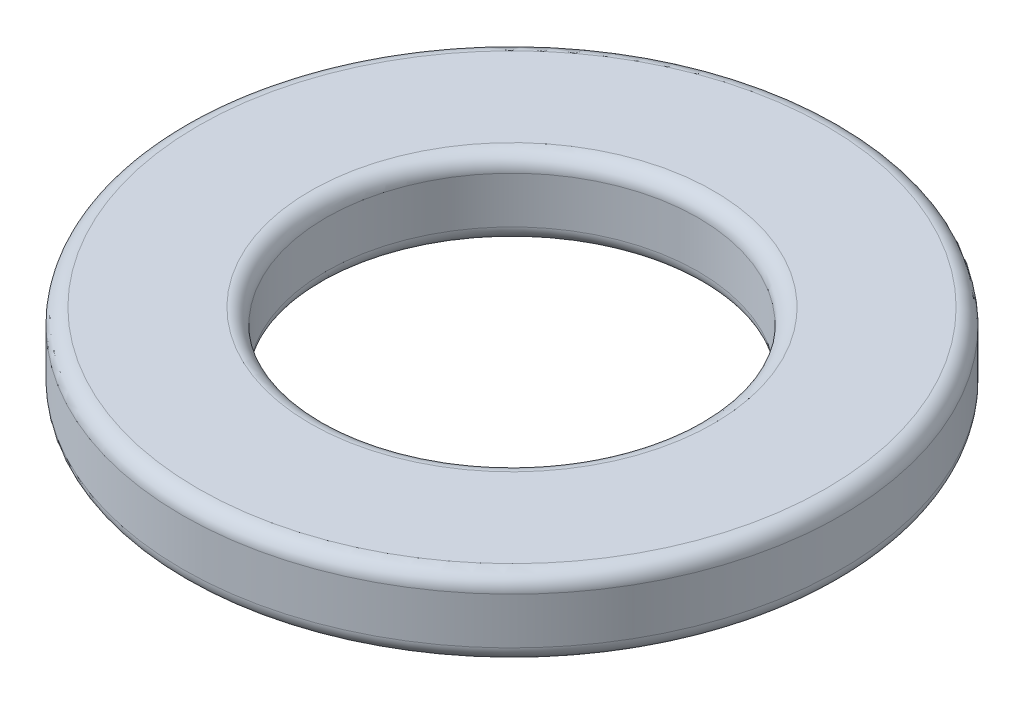
ISO-10303-21;
HEADER;
FILE_DESCRIPTION(('STEP AP214'),'2;1');
FILE_NAME('part.step','',(''),(''),'','','');
FILE_SCHEMA(('AUTOMOTIVE_DESIGN { 1 0 10303 214 1 1 1 1 }'));
ENDSEC;
DATA;
#1=APPLICATION_CONTEXT('core data for automotive mechanical design processes');
#2=APPLICATION_PROTOCOL_DEFINITION('international standard','automotive_design',2000,#1);
#3=PRODUCT_CONTEXT('',#1,'mechanical');
#4=PRODUCT('Part','Part','',(#3));
#5=PRODUCT_RELATED_PRODUCT_CATEGORY('part','',(#4));
#6=PRODUCT_DEFINITION_FORMATION('','',#4);
#7=PRODUCT_DEFINITION_CONTEXT('part definition',#1,'design');
#8=PRODUCT_DEFINITION('design','',#6,#7);
#9=PRODUCT_DEFINITION_SHAPE('','',#8);
#10=(LENGTH_UNIT() NAMED_UNIT(*) SI_UNIT(.MILLI.,.METRE.));
#11=(NAMED_UNIT(*) PLANE_ANGLE_UNIT() SI_UNIT($,.RADIAN.));
#12=(NAMED_UNIT(*) SI_UNIT($,.STERADIAN.) SOLID_ANGLE_UNIT());
#13=UNCERTAINTY_MEASURE_WITH_UNIT(LENGTH_MEASURE(1.E-05),#10,'distance_accuracy_value','');
#14=(GEOMETRIC_REPRESENTATION_CONTEXT(3) GLOBAL_UNCERTAINTY_ASSIGNED_CONTEXT((#13)) GLOBAL_UNIT_ASSIGNED_CONTEXT((#10,
#11,#12)) REPRESENTATION_CONTEXT('',''));
#15=CARTESIAN_POINT('',(0.,0.,0.));
#16=DIRECTION('',(0.,0.,1.));
#17=DIRECTION('',(1.,0.,0.));
#18=AXIS2_PLACEMENT_3D('',#15,#16,#17);
#19=CARTESIAN_POINT('',(0.,1.,0.));
#20=DIRECTION('',(0.,1.,0.));
#21=DIRECTION('',(0.,0.,1.));
#22=AXIS2_PLACEMENT_3D('',#19,#20,#21);
#23=PLANE('',#22);
#24=CARTESIAN_POINT('',(0.,1.,0.));
#25=DIRECTION('',(0.,1.,0.));
#26=DIRECTION('',(0.,0.,1.));
#27=AXIS2_PLACEMENT_3D('',#24,#25,#26);
#28=CIRCLE('',#27,4.05);
#29=CARTESIAN_POINT('',(0.,1.,4.05));
#30=VERTEX_POINT('',#29);
#31=EDGE_CURVE('E10',#30,#30,#28,.T.);
#32=ORIENTED_EDGE('',*,*,#31,.T.);
#33=EDGE_LOOP('',(#32));
#34=FACE_BOUND('',#33,.T.);
#35=CARTESIAN_POINT('',(0.,1.,0.));
#36=DIRECTION('',(0.,1.,0.));
#37=DIRECTION('',(0.,0.,1.));
#38=AXIS2_PLACEMENT_3D('',#35,#36,#37);
#39=CIRCLE('',#38,2.6);
#40=CARTESIAN_POINT('',(0.,1.,2.6));
#41=VERTEX_POINT('',#40);
#42=EDGE_CURVE('E50',#41,#41,#39,.F.);
#43=ORIENTED_EDGE('',*,*,#42,.T.);
#44=EDGE_LOOP('',(#43));
#45=FACE_BOUND('',#44,.T.);
#46=ADVANCED_FACE('F43',(#34,#45),#23,.T.);
#47=CARTESIAN_POINT('',(0.,0.,0.));
#48=DIRECTION('',(0.,1.,0.));
#49=DIRECTION('',(0.,0.,1.));
#50=AXIS2_PLACEMENT_3D('',#47,#48,#49);
#51=PLANE('',#50);
#52=CARTESIAN_POINT('',(0.,0.,0.));
#53=DIRECTION('',(0.,1.,0.));
#54=DIRECTION('',(0.,0.,1.));
#55=AXIS2_PLACEMENT_3D('',#52,#53,#54);
#56=CIRCLE('',#55,2.6);
#57=CARTESIAN_POINT('',(0.,0.,2.6));
#58=VERTEX_POINT('',#57);
#59=EDGE_CURVE('E69',#58,#58,#56,.T.);
#60=ORIENTED_EDGE('',*,*,#59,.T.);
#61=EDGE_LOOP('',(#60));
#62=FACE_BOUND('',#61,.T.);
#63=CARTESIAN_POINT('',(0.,0.,0.));
#64=DIRECTION('',(0.,1.,0.));
#65=DIRECTION('',(0.,0.,1.));
#66=AXIS2_PLACEMENT_3D('',#63,#64,#65);
#67=CIRCLE('',#66,4.05);
#68=CARTESIAN_POINT('',(0.,0.,4.05));
#69=VERTEX_POINT('',#68);
#70=EDGE_CURVE('E72',#69,#69,#67,.F.);
#71=ORIENTED_EDGE('',*,*,#70,.T.);
#72=EDGE_LOOP('',(#71));
#73=FACE_BOUND('',#72,.T.);
#74=ADVANCED_FACE('F76',(#62,#73),#51,.F.);
#75=CARTESIAN_POINT('',(0.,1.,0.));
#76=DIRECTION('',(0.,-1.,0.));
#77=DIRECTION('',(0.,0.,-1.));
#78=AXIS2_PLACEMENT_3D('',#75,#76,#77);
#79=CYLINDRICAL_SURFACE('',#78,4.25);
#80=CARTESIAN_POINT('',(0.,0.2,0.));
#81=DIRECTION('',(0.,1.,0.));
#82=DIRECTION('',(0.,0.,1.));
#83=AXIS2_PLACEMENT_3D('',#80,#81,#82);
#84=CIRCLE('',#83,4.25);
#85=CARTESIAN_POINT('',(0.,0.2,4.25));
#86=VERTEX_POINT('',#85);
#87=EDGE_CURVE('E54',#86,#86,#84,.T.);
#88=ORIENTED_EDGE('',*,*,#87,.T.);
#89=EDGE_LOOP('',(#88));
#90=FACE_BOUND('',#89,.T.);
#91=CARTESIAN_POINT('',(0.,0.8,0.));
#92=DIRECTION('',(0.,1.,0.));
#93=DIRECTION('',(0.,0.,1.));
#94=AXIS2_PLACEMENT_3D('',#91,#92,#93);
#95=CIRCLE('',#94,4.25);
#96=CARTESIAN_POINT('',(0.,0.8,4.25));
#97=VERTEX_POINT('',#96);
#98=EDGE_CURVE('E58',#97,#97,#95,.F.);
#99=ORIENTED_EDGE('',*,*,#98,.T.);
#100=EDGE_LOOP('',(#99));
#101=FACE_BOUND('',#100,.T.);
#102=ADVANCED_FACE('F86',(#90,#101),#79,.T.);
#103=CARTESIAN_POINT('',(0.,1.,0.));
#104=DIRECTION('',(0.,-1.,0.));
#105=DIRECTION('',(0.,0.,-1.));
#106=AXIS2_PLACEMENT_3D('',#103,#104,#105);
#107=CYLINDRICAL_SURFACE('',#106,2.4);
#108=CARTESIAN_POINT('',(0.,0.2,0.));
#109=DIRECTION('',(0.,1.,0.));
#110=DIRECTION('',(0.,0.,1.));
#111=AXIS2_PLACEMENT_3D('',#108,#109,#110);
#112=CIRCLE('',#111,2.4);
#113=CARTESIAN_POINT('',(0.,0.2,2.4));
#114=VERTEX_POINT('',#113);
#115=EDGE_CURVE('E63',#114,#114,#112,.F.);
#116=ORIENTED_EDGE('',*,*,#115,.T.);
#117=EDGE_LOOP('',(#116));
#118=FACE_BOUND('',#117,.T.);
#119=CARTESIAN_POINT('',(0.,0.8,0.));
#120=DIRECTION('',(0.,1.,0.));
#121=DIRECTION('',(0.,0.,1.));
#122=AXIS2_PLACEMENT_3D('',#119,#120,#121);
#123=CIRCLE('',#122,2.4);
#124=CARTESIAN_POINT('',(0.,0.8,2.4));
#125=VERTEX_POINT('',#124);
#126=EDGE_CURVE('E66',#125,#125,#123,.T.);
#127=ORIENTED_EDGE('',*,*,#126,.T.);
#128=EDGE_LOOP('',(#127));
#129=FACE_BOUND('',#128,.T.);
#130=ADVANCED_FACE('F89',(#118,#129),#107,.F.);
#131=CARTESIAN_POINT('',(0.,0.2,0.));
#132=DIRECTION('',(0.,1.,0.));
#133=DIRECTION('',(0.,0.,1.));
#134=AXIS2_PLACEMENT_3D('',#131,#132,#133);
#135=TOROIDAL_SURFACE('',#134,2.6,0.2);
#136=ORIENTED_EDGE('',*,*,#115,.F.);
#137=EDGE_LOOP('',(#136));
#138=FACE_BOUND('',#137,.T.);
#139=ORIENTED_EDGE('',*,*,#59,.F.);
#140=EDGE_LOOP('',(#139));
#141=FACE_BOUND('',#140,.T.);
#142=ADVANCED_FACE('F82',(#138,#141),#135,.T.);
#143=CARTESIAN_POINT('',(0.,0.2,0.));
#144=DIRECTION('',(0.,1.,0.));
#145=DIRECTION('',(0.,0.,1.));
#146=AXIS2_PLACEMENT_3D('',#143,#144,#145);
#147=TOROIDAL_SURFACE('',#146,4.05,0.2);
#148=ORIENTED_EDGE('',*,*,#70,.F.);
#149=EDGE_LOOP('',(#148));
#150=FACE_BOUND('',#149,.T.);
#151=ORIENTED_EDGE('',*,*,#87,.F.);
#152=EDGE_LOOP('',(#151));
#153=FACE_BOUND('',#152,.T.);
#154=ADVANCED_FACE('F78',(#150,#153),#147,.T.);
#155=CARTESIAN_POINT('',(0.,0.8,0.));
#156=DIRECTION('',(0.,1.,0.));
#157=DIRECTION('',(0.,0.,1.));
#158=AXIS2_PLACEMENT_3D('',#155,#156,#157);
#159=TOROIDAL_SURFACE('',#158,4.05,0.2);
#160=ORIENTED_EDGE('',*,*,#98,.F.);
#161=EDGE_LOOP('',(#160));
#162=FACE_BOUND('',#161,.T.);
#163=ORIENTED_EDGE('',*,*,#31,.F.);
#164=EDGE_LOOP('',(#163));
#165=FACE_BOUND('',#164,.T.);
#166=ADVANCED_FACE('F81',(#162,#165),#159,.T.);
#167=CARTESIAN_POINT('',(0.,0.8,0.));
#168=DIRECTION('',(0.,1.,0.));
#169=DIRECTION('',(0.,0.,1.));
#170=AXIS2_PLACEMENT_3D('',#167,#168,#169);
#171=TOROIDAL_SURFACE('',#170,2.6,0.2);
#172=ORIENTED_EDGE('',*,*,#42,.F.);
#173=EDGE_LOOP('',(#172));
#174=FACE_BOUND('',#173,.T.);
#175=ORIENTED_EDGE('',*,*,#126,.F.);
#176=EDGE_LOOP('',(#175));
#177=FACE_BOUND('',#176,.T.);
#178=ADVANCED_FACE('F45',(#174,#177),#171,.T.);
#179=CLOSED_SHELL('',(#46,#74,#102,#130,#142,#154,#166,#178));
#180=MANIFOLD_SOLID_BREP('B2',#179);
#181=ADVANCED_BREP_SHAPE_REPRESENTATION('',(#18,#180),#14);
#182=SHAPE_DEFINITION_REPRESENTATION(#9,#181);
ENDSEC;
END-ISO-10303-21;
